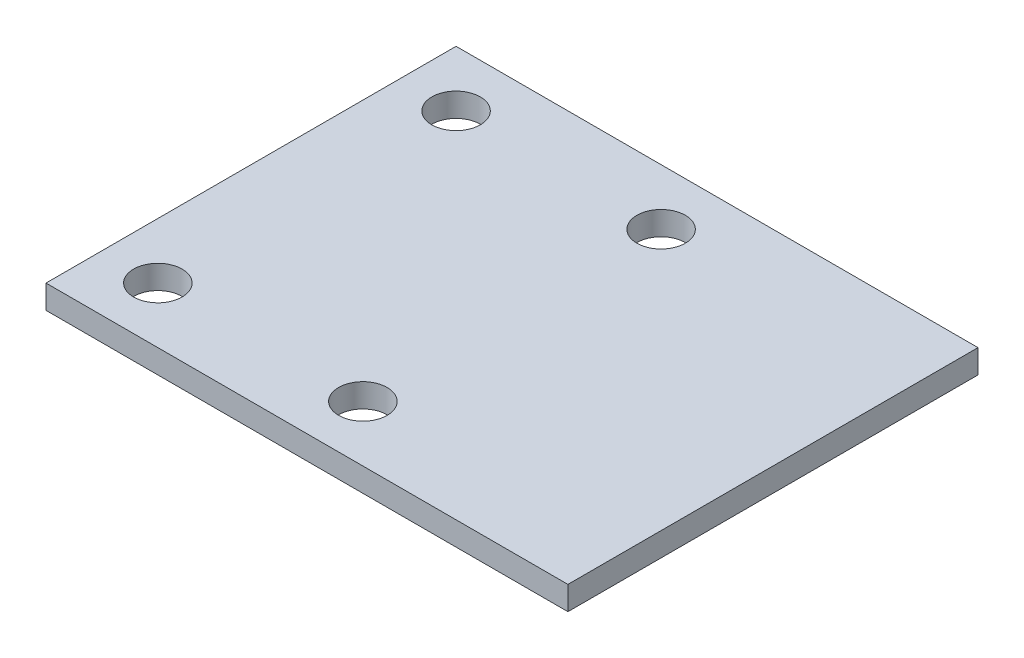
ISO-10303-21;
HEADER;
FILE_DESCRIPTION(('STEP AP214'),'2;1');
FILE_NAME('part.step','',(''),(''),'','','');
FILE_SCHEMA(('AUTOMOTIVE_DESIGN { 1 0 10303 214 1 1 1 1 }'));
ENDSEC;
DATA;
#1=APPLICATION_CONTEXT('core data for automotive mechanical design processes');
#2=APPLICATION_PROTOCOL_DEFINITION('international standard','automotive_design',2000,#1);
#3=PRODUCT_CONTEXT('',#1,'mechanical');
#4=PRODUCT('Part','Part','',(#3));
#5=PRODUCT_RELATED_PRODUCT_CATEGORY('part','',(#4));
#6=PRODUCT_DEFINITION_FORMATION('','',#4);
#7=PRODUCT_DEFINITION_CONTEXT('part definition',#1,'design');
#8=PRODUCT_DEFINITION('design','',#6,#7);
#9=PRODUCT_DEFINITION_SHAPE('','',#8);
#10=(LENGTH_UNIT() NAMED_UNIT(*) SI_UNIT(.MILLI.,.METRE.));
#11=(NAMED_UNIT(*) PLANE_ANGLE_UNIT() SI_UNIT($,.RADIAN.));
#12=(NAMED_UNIT(*) SI_UNIT($,.STERADIAN.) SOLID_ANGLE_UNIT());
#13=UNCERTAINTY_MEASURE_WITH_UNIT(LENGTH_MEASURE(1.E-05),#10,'distance_accuracy_value','');
#14=(GEOMETRIC_REPRESENTATION_CONTEXT(3) GLOBAL_UNCERTAINTY_ASSIGNED_CONTEXT((#13)) GLOBAL_UNIT_ASSIGNED_CONTEXT((#10,
#11,#12)) REPRESENTATION_CONTEXT('',''));
#15=CARTESIAN_POINT('',(0.,0.,0.));
#16=DIRECTION('',(0.,0.,1.));
#17=DIRECTION('',(1.,0.,0.));
#18=AXIS2_PLACEMENT_3D('',#15,#16,#17);
#19=CARTESIAN_POINT('',(0.,1.27,8.));
#20=DIRECTION('',(0.,-1.,0.));
#21=DIRECTION('',(0.,0.,-1.));
#22=AXIS2_PLACEMENT_3D('',#19,#20,#21);
#23=CYLINDRICAL_SURFACE('',#22,1.2999974);
#24=CARTESIAN_POINT('',(0.,1.27,8.));
#25=DIRECTION('',(0.,1.,0.));
#26=DIRECTION('',(0.,0.,1.));
#27=AXIS2_PLACEMENT_3D('',#24,#25,#26);
#28=CIRCLE('',#27,1.2999974);
#29=CARTESIAN_POINT('',(0.,1.27,9.2999974));
#30=VERTEX_POINT('',#29);
#31=EDGE_CURVE('E44',#30,#30,#28,.T.);
#32=ORIENTED_EDGE('',*,*,#31,.T.);
#33=EDGE_LOOP('',(#32));
#34=FACE_BOUND('',#33,.T.);
#35=CARTESIAN_POINT('',(0.,0.,8.));
#36=DIRECTION('',(0.,1.,0.));
#37=DIRECTION('',(0.,0.,1.));
#38=AXIS2_PLACEMENT_3D('',#35,#36,#37);
#39=CIRCLE('',#38,1.2999974);
#40=CARTESIAN_POINT('',(0.,0.,9.2999974));
#41=VERTEX_POINT('',#40);
#42=EDGE_CURVE('E11',#41,#41,#39,.T.);
#43=ORIENTED_EDGE('',*,*,#42,.F.);
#44=EDGE_LOOP('',(#43));
#45=FACE_BOUND('',#44,.T.);
#46=ADVANCED_FACE('F36',(#34,#45),#23,.F.);
#47=CARTESIAN_POINT('',(-11.,1.27,8.));
#48=DIRECTION('',(0.,-1.,0.));
#49=DIRECTION('',(0.,0.,-1.));
#50=AXIS2_PLACEMENT_3D('',#47,#48,#49);
#51=CYLINDRICAL_SURFACE('',#50,1.2999974);
#52=CARTESIAN_POINT('',(-11.,1.27,8.));
#53=DIRECTION('',(0.,1.,0.));
#54=DIRECTION('',(0.,0.,1.));
#55=AXIS2_PLACEMENT_3D('',#52,#53,#54);
#56=CIRCLE('',#55,1.2999974);
#57=CARTESIAN_POINT('',(-11.,1.27,9.2999974));
#58=VERTEX_POINT('',#57);
#59=EDGE_CURVE('E114',#58,#58,#56,.T.);
#60=ORIENTED_EDGE('',*,*,#59,.T.);
#61=EDGE_LOOP('',(#60));
#62=FACE_BOUND('',#61,.T.);
#63=CARTESIAN_POINT('',(-11.,0.,8.));
#64=DIRECTION('',(0.,1.,0.));
#65=DIRECTION('',(0.,0.,1.));
#66=AXIS2_PLACEMENT_3D('',#63,#64,#65);
#67=CIRCLE('',#66,1.2999974);
#68=CARTESIAN_POINT('',(-11.,0.,9.2999974));
#69=VERTEX_POINT('',#68);
#70=EDGE_CURVE('E117',#69,#69,#67,.T.);
#71=ORIENTED_EDGE('',*,*,#70,.F.);
#72=EDGE_LOOP('',(#71));
#73=FACE_BOUND('',#72,.T.);
#74=ADVANCED_FACE('F141',(#62,#73),#51,.F.);
#75=CARTESIAN_POINT('',(-14.,1.27,-11.));
#76=DIRECTION('',(1.,0.,0.));
#77=DIRECTION('',(0.,0.,-1.));
#78=AXIS2_PLACEMENT_3D('',#75,#76,#77);
#79=PLANE('',#78);
#80=DIRECTION('',(0.,0.,1.));
#81=VECTOR('',#80,1.);
#82=CARTESIAN_POINT('',(-14.,0.,-11.));
#83=LINE('',#82,#81);
#84=CARTESIAN_POINT('',(-14.,0.,-11.));
#85=VERTEX_POINT('',#84);
#86=CARTESIAN_POINT('',(-14.,0.,11.));
#87=VERTEX_POINT('',#86);
#88=EDGE_CURVE('E104',#85,#87,#83,.T.);
#89=ORIENTED_EDGE('',*,*,#88,.T.);
#90=DIRECTION('',(0.,-1.,0.));
#91=VECTOR('',#90,1.);
#92=CARTESIAN_POINT('',(-14.,1.27,11.));
#93=LINE('',#92,#91);
#94=CARTESIAN_POINT('',(-14.,1.27,11.));
#95=VERTEX_POINT('',#94);
#96=EDGE_CURVE('E95',#95,#87,#93,.T.);
#97=ORIENTED_EDGE('',*,*,#96,.F.);
#98=DIRECTION('',(0.,0.,1.));
#99=VECTOR('',#98,1.);
#100=CARTESIAN_POINT('',(-14.,1.27,-11.));
#101=LINE('',#100,#99);
#102=CARTESIAN_POINT('',(-14.,1.27,-11.));
#103=VERTEX_POINT('',#102);
#104=EDGE_CURVE('E89',#103,#95,#101,.T.);
#105=ORIENTED_EDGE('',*,*,#104,.F.);
#106=DIRECTION('',(0.,-1.,0.));
#107=VECTOR('',#106,1.);
#108=CARTESIAN_POINT('',(-14.,1.27,-11.));
#109=LINE('',#108,#107);
#110=EDGE_CURVE('E100',#103,#85,#109,.T.);
#111=ORIENTED_EDGE('',*,*,#110,.T.);
#112=EDGE_LOOP('',(#89,#97,#105,#111));
#113=FACE_BOUND('',#112,.T.);
#114=ADVANCED_FACE('F145',(#113),#79,.F.);
#115=CARTESIAN_POINT('',(-14.,1.27,11.));
#116=DIRECTION('',(0.,0.,-1.));
#117=DIRECTION('',(-1.,0.,0.));
#118=AXIS2_PLACEMENT_3D('',#115,#116,#117);
#119=PLANE('',#118);
#120=DIRECTION('',(1.,0.,0.));
#121=VECTOR('',#120,1.);
#122=CARTESIAN_POINT('',(-14.,0.,11.));
#123=LINE('',#122,#121);
#124=CARTESIAN_POINT('',(14.,0.,11.));
#125=VERTEX_POINT('',#124);
#126=EDGE_CURVE('E94',#87,#125,#123,.T.);
#127=ORIENTED_EDGE('',*,*,#126,.T.);
#128=DIRECTION('',(0.,-1.,0.));
#129=VECTOR('',#128,1.);
#130=CARTESIAN_POINT('',(14.,1.27,11.));
#131=LINE('',#130,#129);
#132=CARTESIAN_POINT('',(14.,1.27,11.));
#133=VERTEX_POINT('',#132);
#134=EDGE_CURVE('E92',#133,#125,#131,.T.);
#135=ORIENTED_EDGE('',*,*,#134,.F.);
#136=DIRECTION('',(1.,0.,0.));
#137=VECTOR('',#136,1.);
#138=CARTESIAN_POINT('',(-14.,1.27,11.));
#139=LINE('',#138,#137);
#140=EDGE_CURVE('E83',#95,#133,#139,.T.);
#141=ORIENTED_EDGE('',*,*,#140,.F.);
#142=ORIENTED_EDGE('',*,*,#96,.T.);
#143=EDGE_LOOP('',(#127,#135,#141,#142));
#144=FACE_BOUND('',#143,.T.);
#145=ADVANCED_FACE('F93',(#144),#119,.F.);
#146=CARTESIAN_POINT('',(14.,1.27,-11.));
#147=DIRECTION('',(-1.,0.,0.));
#148=DIRECTION('',(0.,0.,1.));
#149=AXIS2_PLACEMENT_3D('',#146,#147,#148);
#150=PLANE('',#149);
#151=DIRECTION('',(0.,0.,-1.));
#152=VECTOR('',#151,1.);
#153=CARTESIAN_POINT('',(14.,0.,-11.));
#154=LINE('',#153,#152);
#155=CARTESIAN_POINT('',(14.,0.,-11.));
#156=VERTEX_POINT('',#155);
#157=EDGE_CURVE('E69',#125,#156,#154,.T.);
#158=ORIENTED_EDGE('',*,*,#157,.T.);
#159=DIRECTION('',(0.,-1.,0.));
#160=VECTOR('',#159,1.);
#161=CARTESIAN_POINT('',(14.,1.27,-11.));
#162=LINE('',#161,#160);
#163=CARTESIAN_POINT('',(14.,1.27,-11.));
#164=VERTEX_POINT('',#163);
#165=EDGE_CURVE('E96',#164,#156,#162,.T.);
#166=ORIENTED_EDGE('',*,*,#165,.F.);
#167=DIRECTION('',(0.,0.,-1.));
#168=VECTOR('',#167,1.);
#169=CARTESIAN_POINT('',(14.,1.27,-11.));
#170=LINE('',#169,#168);
#171=EDGE_CURVE('E87',#133,#164,#170,.T.);
#172=ORIENTED_EDGE('',*,*,#171,.F.);
#173=ORIENTED_EDGE('',*,*,#134,.T.);
#174=EDGE_LOOP('',(#158,#166,#172,#173));
#175=FACE_BOUND('',#174,.T.);
#176=ADVANCED_FACE('F98',(#175),#150,.F.);
#177=CARTESIAN_POINT('',(-14.,1.27,-11.));
#178=DIRECTION('',(0.,0.,1.));
#179=DIRECTION('',(1.,0.,0.));
#180=AXIS2_PLACEMENT_3D('',#177,#178,#179);
#181=PLANE('',#180);
#182=DIRECTION('',(-1.,0.,0.));
#183=VECTOR('',#182,1.);
#184=CARTESIAN_POINT('',(-14.,0.,-11.));
#185=LINE('',#184,#183);
#186=EDGE_CURVE('E75',#156,#85,#185,.T.);
#187=ORIENTED_EDGE('',*,*,#186,.T.);
#188=ORIENTED_EDGE('',*,*,#110,.F.);
#189=DIRECTION('',(-1.,0.,0.));
#190=VECTOR('',#189,1.);
#191=CARTESIAN_POINT('',(-14.,1.27,-11.));
#192=LINE('',#191,#190);
#193=EDGE_CURVE('E52',#164,#103,#192,.T.);
#194=ORIENTED_EDGE('',*,*,#193,.F.);
#195=ORIENTED_EDGE('',*,*,#165,.T.);
#196=EDGE_LOOP('',(#187,#188,#194,#195));
#197=FACE_BOUND('',#196,.T.);
#198=ADVANCED_FACE('F126',(#197),#181,.F.);
#199=CARTESIAN_POINT('',(0.,1.27,0.));
#200=DIRECTION('',(0.,1.,0.));
#201=DIRECTION('',(0.,0.,1.));
#202=AXIS2_PLACEMENT_3D('',#199,#200,#201);
#203=PLANE('',#202);
#204=CARTESIAN_POINT('',(0.,1.27,-8.));
#205=DIRECTION('',(0.,1.,0.));
#206=DIRECTION('',(0.,0.,1.));
#207=AXIS2_PLACEMENT_3D('',#204,#205,#206);
#208=CIRCLE('',#207,1.2999974);
#209=CARTESIAN_POINT('',(0.,1.27,-6.7000026));
#210=VERTEX_POINT('',#209);
#211=EDGE_CURVE('E207',#210,#210,#208,.T.);
#212=ORIENTED_EDGE('',*,*,#211,.F.);
#213=EDGE_LOOP('',(#212));
#214=FACE_BOUND('',#213,.T.);
#215=CARTESIAN_POINT('',(-11.,1.27,-8.));
#216=DIRECTION('',(0.,1.,0.));
#217=DIRECTION('',(0.,0.,1.));
#218=AXIS2_PLACEMENT_3D('',#215,#216,#217);
#219=CIRCLE('',#218,1.2999974);
#220=CARTESIAN_POINT('',(-11.,1.27,-6.7000026));
#221=VERTEX_POINT('',#220);
#222=EDGE_CURVE('E107',#221,#221,#219,.T.);
#223=ORIENTED_EDGE('',*,*,#222,.F.);
#224=EDGE_LOOP('',(#223));
#225=FACE_BOUND('',#224,.T.);
#226=ORIENTED_EDGE('',*,*,#104,.T.);
#227=ORIENTED_EDGE('',*,*,#140,.T.);
#228=ORIENTED_EDGE('',*,*,#171,.T.);
#229=ORIENTED_EDGE('',*,*,#193,.T.);
#230=EDGE_LOOP('',(#226,#227,#228,#229));
#231=FACE_BOUND('',#230,.T.);
#232=ORIENTED_EDGE('',*,*,#59,.F.);
#233=EDGE_LOOP('',(#232));
#234=FACE_BOUND('',#233,.T.);
#235=ORIENTED_EDGE('',*,*,#31,.F.);
#236=EDGE_LOOP('',(#235));
#237=FACE_BOUND('',#236,.T.);
#238=ADVANCED_FACE('F84',(#214,#225,#231,#234,#237),#203,.T.);
#239=CARTESIAN_POINT('',(0.,0.,0.));
#240=DIRECTION('',(0.,1.,0.));
#241=DIRECTION('',(0.,0.,1.));
#242=AXIS2_PLACEMENT_3D('',#239,#240,#241);
#243=PLANE('',#242);
#244=CARTESIAN_POINT('',(0.,0.,-8.));
#245=DIRECTION('',(0.,1.,0.));
#246=DIRECTION('',(0.,0.,1.));
#247=AXIS2_PLACEMENT_3D('',#244,#245,#246);
#248=CIRCLE('',#247,1.2999974);
#249=CARTESIAN_POINT('',(0.,0.,-6.7000026));
#250=VERTEX_POINT('',#249);
#251=EDGE_CURVE('E210',#250,#250,#248,.T.);
#252=ORIENTED_EDGE('',*,*,#251,.T.);
#253=EDGE_LOOP('',(#252));
#254=FACE_BOUND('',#253,.T.);
#255=CARTESIAN_POINT('',(-11.,0.,-8.));
#256=DIRECTION('',(0.,1.,0.));
#257=DIRECTION('',(0.,0.,1.));
#258=AXIS2_PLACEMENT_3D('',#255,#256,#257);
#259=CIRCLE('',#258,1.2999974);
#260=CARTESIAN_POINT('',(-11.,0.,-6.7000026));
#261=VERTEX_POINT('',#260);
#262=EDGE_CURVE('E211',#261,#261,#259,.T.);
#263=ORIENTED_EDGE('',*,*,#262,.T.);
#264=EDGE_LOOP('',(#263));
#265=FACE_BOUND('',#264,.T.);
#266=ORIENTED_EDGE('',*,*,#88,.F.);
#267=ORIENTED_EDGE('',*,*,#186,.F.);
#268=ORIENTED_EDGE('',*,*,#157,.F.);
#269=ORIENTED_EDGE('',*,*,#126,.F.);
#270=EDGE_LOOP('',(#266,#267,#268,#269));
#271=FACE_BOUND('',#270,.T.);
#272=ORIENTED_EDGE('',*,*,#70,.T.);
#273=EDGE_LOOP('',(#272));
#274=FACE_BOUND('',#273,.T.);
#275=ORIENTED_EDGE('',*,*,#42,.T.);
#276=EDGE_LOOP('',(#275));
#277=FACE_BOUND('',#276,.T.);
#278=ADVANCED_FACE('F125',(#254,#265,#271,#274,#277),#243,.F.);
#279=CARTESIAN_POINT('',(-11.,1.27,-8.));
#280=DIRECTION('',(0.,-1.,0.));
#281=DIRECTION('',(0.,0.,-1.));
#282=AXIS2_PLACEMENT_3D('',#279,#280,#281);
#283=CYLINDRICAL_SURFACE('',#282,1.2999974);
#284=ORIENTED_EDGE('',*,*,#222,.T.);
#285=EDGE_LOOP('',(#284));
#286=FACE_BOUND('',#285,.T.);
#287=ORIENTED_EDGE('',*,*,#262,.F.);
#288=EDGE_LOOP('',(#287));
#289=FACE_BOUND('',#288,.T.);
#290=ADVANCED_FACE('F133',(#286,#289),#283,.F.);
#291=CARTESIAN_POINT('',(0.,1.27,-8.));
#292=DIRECTION('',(0.,-1.,0.));
#293=DIRECTION('',(0.,0.,-1.));
#294=AXIS2_PLACEMENT_3D('',#291,#292,#293);
#295=CYLINDRICAL_SURFACE('',#294,1.2999974);
#296=ORIENTED_EDGE('',*,*,#211,.T.);
#297=EDGE_LOOP('',(#296));
#298=FACE_BOUND('',#297,.T.);
#299=ORIENTED_EDGE('',*,*,#251,.F.);
#300=EDGE_LOOP('',(#299));
#301=FACE_BOUND('',#300,.T.);
#302=ADVANCED_FACE('F174',(#298,#301),#295,.F.);
#303=CLOSED_SHELL('',(#46,#74,#114,#145,#176,#198,#238,#278,#290,#302));
#304=MANIFOLD_SOLID_BREP('B2',#303);
#305=ADVANCED_BREP_SHAPE_REPRESENTATION('',(#18,#304),#14);
#306=SHAPE_DEFINITION_REPRESENTATION(#9,#305);
ENDSEC;
END-ISO-10303-21;
